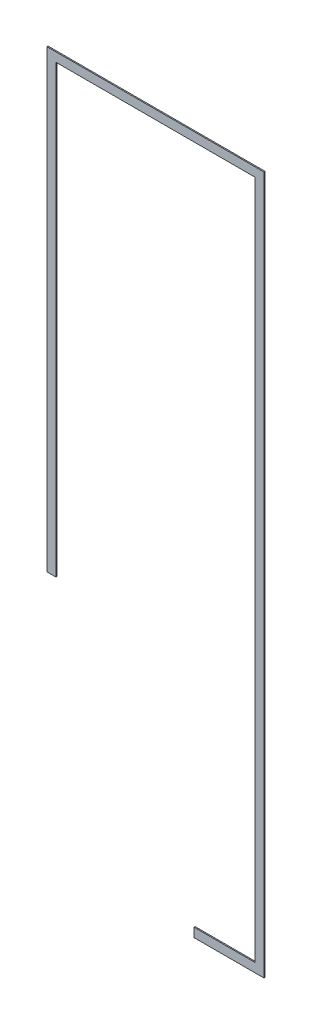
ISO-10303-21;
HEADER;
FILE_DESCRIPTION(('STEP AP214'),'2;1');
FILE_NAME('part.step','',(''),(''),'','','');
FILE_SCHEMA(('AUTOMOTIVE_DESIGN { 1 0 10303 214 1 1 1 1 }'));
ENDSEC;
DATA;
#1=APPLICATION_CONTEXT('core data for automotive mechanical design processes');
#2=APPLICATION_PROTOCOL_DEFINITION('international standard','automotive_design',2000,#1);
#3=PRODUCT_CONTEXT('',#1,'mechanical');
#4=PRODUCT('Part','Part','',(#3));
#5=PRODUCT_RELATED_PRODUCT_CATEGORY('part','',(#4));
#6=PRODUCT_DEFINITION_FORMATION('','',#4);
#7=PRODUCT_DEFINITION_CONTEXT('part definition',#1,'design');
#8=PRODUCT_DEFINITION('design','',#6,#7);
#9=PRODUCT_DEFINITION_SHAPE('','',#8);
#10=(LENGTH_UNIT() NAMED_UNIT(*) SI_UNIT(.MILLI.,.METRE.));
#11=(NAMED_UNIT(*) PLANE_ANGLE_UNIT() SI_UNIT($,.RADIAN.));
#12=(NAMED_UNIT(*) SI_UNIT($,.STERADIAN.) SOLID_ANGLE_UNIT());
#13=UNCERTAINTY_MEASURE_WITH_UNIT(LENGTH_MEASURE(1.E-05),#10,'distance_accuracy_value','');
#14=(GEOMETRIC_REPRESENTATION_CONTEXT(3) GLOBAL_UNCERTAINTY_ASSIGNED_CONTEXT((#13)) GLOBAL_UNIT_ASSIGNED_CONTEXT((#10,
#11,#12)) REPRESENTATION_CONTEXT('',''));
#15=CARTESIAN_POINT('',(0.,0.,0.));
#16=DIRECTION('',(0.,0.,1.));
#17=DIRECTION('',(1.,0.,0.));
#18=AXIS2_PLACEMENT_3D('',#15,#16,#17);
#19=CARTESIAN_POINT('',(5890.08691054199,-2228.56735908509,0.));
#20=DIRECTION('',(0.,0.,1.));
#21=DIRECTION('',(1.,0.,0.));
#22=AXIS2_PLACEMENT_3D('',#19,#20,#21);
#23=PLANE('',#22);
#24=DIRECTION('',(-1.,0.,0.));
#25=VECTOR('',#24,1.);
#26=CARTESIAN_POINT('',(5890.08691054199,-260.067359085082,0.));
#27=LINE('',#26,#25);
#28=CARTESIAN_POINT('',(6502.07451054199,-260.067359085083,0.));
#29=VERTEX_POINT('',#28);
#30=CARTESIAN_POINT('',(5278.09931054199,-260.067359085083,0.));
#31=VERTEX_POINT('',#30);
#32=EDGE_CURVE('E148',#29,#31,#27,.T.);
#33=ORIENTED_EDGE('',*,*,#32,.F.);
#34=DIRECTION('',(0.,1.,0.));
#35=VECTOR('',#34,1.);
#36=CARTESIAN_POINT('',(6502.07451054199,-2228.56735908509,0.));
#37=LINE('',#36,#35);
#38=CARTESIAN_POINT('',(6502.07451054199,-4197.06735908508,0.));
#39=VERTEX_POINT('',#38);
#40=EDGE_CURVE('E143',#39,#29,#37,.T.);
#41=ORIENTED_EDGE('',*,*,#40,.F.);
#42=DIRECTION('',(1.,0.,0.));
#43=VECTOR('',#42,1.);
#44=CARTESIAN_POINT('',(6305.22451054199,-4197.06735908508,0.));
#45=LINE('',#44,#43);
#46=CARTESIAN_POINT('',(6108.37451054199,-4197.06735908508,0.));
#47=VERTEX_POINT('',#46);
#48=EDGE_CURVE('E137',#47,#39,#45,.T.);
#49=ORIENTED_EDGE('',*,*,#48,.F.);
#50=DIRECTION('',(0.,1.,0.));
#51=VECTOR('',#50,1.);
#52=CARTESIAN_POINT('',(6108.37451054199,-4171.66735908508,0.));
#53=LINE('',#52,#51);
#54=CARTESIAN_POINT('',(6108.37451054199,-4146.26735908508,0.));
#55=VERTEX_POINT('',#54);
#56=EDGE_CURVE('E131',#55,#47,#53,.F.);
#57=ORIENTED_EDGE('',*,*,#56,.F.);
#58=DIRECTION('',(1.,0.,0.));
#59=VECTOR('',#58,1.);
#60=CARTESIAN_POINT('',(6279.82451054199,-4146.26735908508,0.));
#61=LINE('',#60,#59);
#62=CARTESIAN_POINT('',(6451.27451054199,-4146.26735908508,0.));
#63=VERTEX_POINT('',#62);
#64=EDGE_CURVE('E125',#63,#55,#61,.F.);
#65=ORIENTED_EDGE('',*,*,#64,.F.);
#66=DIRECTION('',(0.,-1.,0.));
#67=VECTOR('',#66,1.);
#68=CARTESIAN_POINT('',(6451.27451054199,-2228.56735908509,0.));
#69=LINE('',#68,#67);
#70=CARTESIAN_POINT('',(6451.27451054199,-310.867359085083,0.));
#71=VERTEX_POINT('',#70);
#72=EDGE_CURVE('E119',#71,#63,#69,.T.);
#73=ORIENTED_EDGE('',*,*,#72,.F.);
#74=DIRECTION('',(1.,0.,0.));
#75=VECTOR('',#74,1.);
#76=CARTESIAN_POINT('',(5890.08691054199,-310.867359085083,0.));
#77=LINE('',#76,#75);
#78=CARTESIAN_POINT('',(5328.89931054199,-310.867359085083,0.));
#79=VERTEX_POINT('',#78);
#80=EDGE_CURVE('E113',#79,#71,#77,.T.);
#81=ORIENTED_EDGE('',*,*,#80,.F.);
#82=DIRECTION('',(0.,1.,0.));
#83=VECTOR('',#82,1.);
#84=CARTESIAN_POINT('',(5328.89931054199,-1568.16735908509,0.));
#85=LINE('',#84,#83);
#86=CARTESIAN_POINT('',(5328.89931054199,-2825.46735908508,0.));
#87=VERTEX_POINT('',#86);
#88=EDGE_CURVE('E89',#87,#79,#85,.T.);
#89=ORIENTED_EDGE('',*,*,#88,.F.);
#90=DIRECTION('',(1.,0.,0.));
#91=VECTOR('',#90,1.);
#92=CARTESIAN_POINT('',(5303.49931054199,-2825.46735908508,0.));
#93=LINE('',#92,#91);
#94=CARTESIAN_POINT('',(5278.09931054199,-2825.46735908508,0.));
#95=VERTEX_POINT('',#94);
#96=EDGE_CURVE('E91',#95,#87,#93,.T.);
#97=ORIENTED_EDGE('',*,*,#96,.F.);
#98=DIRECTION('',(0.,1.,0.));
#99=VECTOR('',#98,1.);
#100=CARTESIAN_POINT('',(5278.09931054199,-1542.76735908508,0.));
#101=LINE('',#100,#99);
#102=EDGE_CURVE('E17',#31,#95,#101,.F.);
#103=ORIENTED_EDGE('',*,*,#102,.F.);
#104=EDGE_LOOP('',(#33,#41,#49,#57,#65,#73,#81,#89,#97,#103));
#105=FACE_BOUND('',#104,.T.);
#106=ADVANCED_FACE('F14',(#105),#23,.F.);
#107=CARTESIAN_POINT('',(5278.09931054199,-1542.76735908508,6.35));
#108=DIRECTION('',(-1.,0.,0.));
#109=DIRECTION('',(0.,0.,1.));
#110=AXIS2_PLACEMENT_3D('',#107,#108,#109);
#111=PLANE('',#110);
#112=DIRECTION('',(0.,1.,0.));
#113=VECTOR('',#112,1.);
#114=CARTESIAN_POINT('',(5278.09931054199,-2228.56735908509,6.35));
#115=LINE('',#114,#113);
#116=CARTESIAN_POINT('',(5278.09931054199,-260.067359085083,6.35));
#117=VERTEX_POINT('',#116);
#118=CARTESIAN_POINT('',(5278.09931054199,-2825.46735908508,6.35));
#119=VERTEX_POINT('',#118);
#120=EDGE_CURVE('E152',#117,#119,#115,.F.);
#121=ORIENTED_EDGE('',*,*,#120,.F.);
#122=DIRECTION('',(0.,0.,1.));
#123=VECTOR('',#122,1.);
#124=CARTESIAN_POINT('',(5278.09931054199,-260.067359085082,6.35));
#125=LINE('',#124,#123);
#126=EDGE_CURVE('E102',#31,#117,#125,.T.);
#127=ORIENTED_EDGE('',*,*,#126,.F.);
#128=ORIENTED_EDGE('',*,*,#102,.T.);
#129=DIRECTION('',(0.,0.,-1.));
#130=VECTOR('',#129,1.);
#131=CARTESIAN_POINT('',(5278.09931054199,-2825.46735908508,6.35));
#132=LINE('',#131,#130);
#133=EDGE_CURVE('E97',#119,#95,#132,.T.);
#134=ORIENTED_EDGE('',*,*,#133,.F.);
#135=EDGE_LOOP('',(#121,#127,#128,#134));
#136=FACE_BOUND('',#135,.T.);
#137=ADVANCED_FACE('F99',(#136),#111,.T.);
#138=CARTESIAN_POINT('',(5303.49931054199,-2825.46735908508,6.35));
#139=DIRECTION('',(0.,-1.,0.));
#140=DIRECTION('',(0.,0.,-1.));
#141=AXIS2_PLACEMENT_3D('',#138,#139,#140);
#142=PLANE('',#141);
#143=DIRECTION('',(1.,0.,0.));
#144=VECTOR('',#143,1.);
#145=CARTESIAN_POINT('',(5890.08691054199,-2825.46735908508,6.35));
#146=LINE('',#145,#144);
#147=CARTESIAN_POINT('',(5328.89931054199,-2825.46735908508,6.35));
#148=VERTEX_POINT('',#147);
#149=EDGE_CURVE('E106',#119,#148,#146,.T.);
#150=ORIENTED_EDGE('',*,*,#149,.F.);
#151=ORIENTED_EDGE('',*,*,#133,.T.);
#152=ORIENTED_EDGE('',*,*,#96,.T.);
#153=DIRECTION('',(0.,0.,-1.));
#154=VECTOR('',#153,1.);
#155=CARTESIAN_POINT('',(5328.89931054199,-2825.46735908508,6.35));
#156=LINE('',#155,#154);
#157=EDGE_CURVE('E109',#148,#87,#156,.T.);
#158=ORIENTED_EDGE('',*,*,#157,.F.);
#159=EDGE_LOOP('',(#150,#151,#152,#158));
#160=FACE_BOUND('',#159,.T.);
#161=ADVANCED_FACE('F104',(#160),#142,.T.);
#162=CARTESIAN_POINT('',(5328.89931054199,-1568.16735908509,6.35));
#163=DIRECTION('',(1.,0.,0.));
#164=DIRECTION('',(0.,0.,-1.));
#165=AXIS2_PLACEMENT_3D('',#162,#163,#164);
#166=PLANE('',#165);
#167=DIRECTION('',(0.,1.,0.));
#168=VECTOR('',#167,1.);
#169=CARTESIAN_POINT('',(5328.89931054199,-2228.56735908509,6.35));
#170=LINE('',#169,#168);
#171=CARTESIAN_POINT('',(5328.89931054199,-310.867359085083,6.35));
#172=VERTEX_POINT('',#171);
#173=EDGE_CURVE('E155',#148,#172,#170,.T.);
#174=ORIENTED_EDGE('',*,*,#173,.F.);
#175=ORIENTED_EDGE('',*,*,#157,.T.);
#176=ORIENTED_EDGE('',*,*,#88,.T.);
#177=DIRECTION('',(0.,0.,1.));
#178=VECTOR('',#177,1.);
#179=CARTESIAN_POINT('',(5328.89931054199,-310.867359085083,6.35));
#180=LINE('',#179,#178);
#181=EDGE_CURVE('E116',#172,#79,#180,.F.);
#182=ORIENTED_EDGE('',*,*,#181,.F.);
#183=EDGE_LOOP('',(#174,#175,#176,#182));
#184=FACE_BOUND('',#183,.T.);
#185=ADVANCED_FACE('F194',(#184),#166,.T.);
#186=CARTESIAN_POINT('',(5890.08691054199,-310.867359085083,6.35));
#187=DIRECTION('',(0.,-1.,0.));
#188=DIRECTION('',(1.,0.,0.));
#189=AXIS2_PLACEMENT_3D('',#186,#187,#188);
#190=PLANE('',#189);
#191=DIRECTION('',(1.,0.,0.));
#192=VECTOR('',#191,1.);
#193=CARTESIAN_POINT('',(5890.08691054199,-310.867359085083,6.35));
#194=LINE('',#193,#192);
#195=CARTESIAN_POINT('',(6451.27451054199,-310.867359085083,6.35));
#196=VERTEX_POINT('',#195);
#197=EDGE_CURVE('E158',#172,#196,#194,.T.);
#198=ORIENTED_EDGE('',*,*,#197,.F.);
#199=ORIENTED_EDGE('',*,*,#181,.T.);
#200=ORIENTED_EDGE('',*,*,#80,.T.);
#201=DIRECTION('',(0.,0.,1.));
#202=VECTOR('',#201,1.);
#203=CARTESIAN_POINT('',(6451.27451054199,-310.867359085083,6.35));
#204=LINE('',#203,#202);
#205=EDGE_CURVE('E122',#196,#71,#204,.F.);
#206=ORIENTED_EDGE('',*,*,#205,.F.);
#207=EDGE_LOOP('',(#198,#199,#200,#206));
#208=FACE_BOUND('',#207,.T.);
#209=ADVANCED_FACE('F191',(#208),#190,.T.);
#210=CARTESIAN_POINT('',(6451.27451054199,-2228.56735908509,6.35));
#211=DIRECTION('',(-1.,0.,0.));
#212=DIRECTION('',(0.,-1.,0.));
#213=AXIS2_PLACEMENT_3D('',#210,#211,#212);
#214=PLANE('',#213);
#215=DIRECTION('',(0.,1.,0.));
#216=VECTOR('',#215,1.);
#217=CARTESIAN_POINT('',(6451.27451054199,-2228.56735908509,6.35));
#218=LINE('',#217,#216);
#219=CARTESIAN_POINT('',(6451.27451054199,-4146.26735908508,6.35));
#220=VERTEX_POINT('',#219);
#221=EDGE_CURVE('E161',#196,#220,#218,.F.);
#222=ORIENTED_EDGE('',*,*,#221,.F.);
#223=ORIENTED_EDGE('',*,*,#205,.T.);
#224=ORIENTED_EDGE('',*,*,#72,.T.);
#225=DIRECTION('',(0.,0.,1.));
#226=VECTOR('',#225,1.);
#227=CARTESIAN_POINT('',(6451.27451054199,-4146.26735908508,6.35));
#228=LINE('',#227,#226);
#229=EDGE_CURVE('E128',#220,#63,#228,.F.);
#230=ORIENTED_EDGE('',*,*,#229,.F.);
#231=EDGE_LOOP('',(#222,#223,#224,#230));
#232=FACE_BOUND('',#231,.T.);
#233=ADVANCED_FACE('F188',(#232),#214,.T.);
#234=CARTESIAN_POINT('',(6279.82451054199,-4146.26735908508,6.35));
#235=DIRECTION('',(0.,1.,0.));
#236=DIRECTION('',(0.,0.,1.));
#237=AXIS2_PLACEMENT_3D('',#234,#235,#236);
#238=PLANE('',#237);
#239=DIRECTION('',(1.,0.,0.));
#240=VECTOR('',#239,1.);
#241=CARTESIAN_POINT('',(5890.08691054199,-4146.26735908508,6.35));
#242=LINE('',#241,#240);
#243=CARTESIAN_POINT('',(6108.37451054199,-4146.26735908508,6.35));
#244=VERTEX_POINT('',#243);
#245=EDGE_CURVE('E164',#220,#244,#242,.F.);
#246=ORIENTED_EDGE('',*,*,#245,.F.);
#247=ORIENTED_EDGE('',*,*,#229,.T.);
#248=ORIENTED_EDGE('',*,*,#64,.T.);
#249=DIRECTION('',(0.,0.,1.));
#250=VECTOR('',#249,1.);
#251=CARTESIAN_POINT('',(6108.37451054199,-4146.26735908508,6.35));
#252=LINE('',#251,#250);
#253=EDGE_CURVE('E134',#244,#55,#252,.F.);
#254=ORIENTED_EDGE('',*,*,#253,.F.);
#255=EDGE_LOOP('',(#246,#247,#248,#254));
#256=FACE_BOUND('',#255,.T.);
#257=ADVANCED_FACE('F185',(#256),#238,.T.);
#258=CARTESIAN_POINT('',(6108.37451054199,-4171.66735908508,6.35));
#259=DIRECTION('',(-1.,0.,0.));
#260=DIRECTION('',(0.,0.,1.));
#261=AXIS2_PLACEMENT_3D('',#258,#259,#260);
#262=PLANE('',#261);
#263=DIRECTION('',(0.,1.,0.));
#264=VECTOR('',#263,1.);
#265=CARTESIAN_POINT('',(6108.37451054199,-2228.56735908509,6.35));
#266=LINE('',#265,#264);
#267=CARTESIAN_POINT('',(6108.37451054199,-4197.06735908508,6.35));
#268=VERTEX_POINT('',#267);
#269=EDGE_CURVE('E167',#244,#268,#266,.F.);
#270=ORIENTED_EDGE('',*,*,#269,.F.);
#271=ORIENTED_EDGE('',*,*,#253,.T.);
#272=ORIENTED_EDGE('',*,*,#56,.T.);
#273=DIRECTION('',(0.,0.,-1.));
#274=VECTOR('',#273,1.);
#275=CARTESIAN_POINT('',(6108.37451054199,-4197.06735908508,6.35));
#276=LINE('',#275,#274);
#277=EDGE_CURVE('E140',#268,#47,#276,.T.);
#278=ORIENTED_EDGE('',*,*,#277,.F.);
#279=EDGE_LOOP('',(#270,#271,#272,#278));
#280=FACE_BOUND('',#279,.T.);
#281=ADVANCED_FACE('F182',(#280),#262,.T.);
#282=CARTESIAN_POINT('',(6305.22451054199,-4197.06735908508,6.35));
#283=DIRECTION('',(0.,-1.,0.));
#284=DIRECTION('',(0.,0.,-1.));
#285=AXIS2_PLACEMENT_3D('',#282,#283,#284);
#286=PLANE('',#285);
#287=DIRECTION('',(1.,0.,0.));
#288=VECTOR('',#287,1.);
#289=CARTESIAN_POINT('',(5890.08691054199,-4197.06735908508,6.35));
#290=LINE('',#289,#288);
#291=CARTESIAN_POINT('',(6502.07451054199,-4197.06735908508,6.35));
#292=VERTEX_POINT('',#291);
#293=EDGE_CURVE('E170',#268,#292,#290,.T.);
#294=ORIENTED_EDGE('',*,*,#293,.F.);
#295=ORIENTED_EDGE('',*,*,#277,.T.);
#296=ORIENTED_EDGE('',*,*,#48,.T.);
#297=DIRECTION('',(0.,0.,-1.));
#298=VECTOR('',#297,1.);
#299=CARTESIAN_POINT('',(6502.07451054199,-4197.06735908508,6.35));
#300=LINE('',#299,#298);
#301=EDGE_CURVE('E145',#292,#39,#300,.T.);
#302=ORIENTED_EDGE('',*,*,#301,.F.);
#303=EDGE_LOOP('',(#294,#295,#296,#302));
#304=FACE_BOUND('',#303,.T.);
#305=ADVANCED_FACE('F179',(#304),#286,.T.);
#306=CARTESIAN_POINT('',(6502.07451054199,-2228.56735908509,6.35));
#307=DIRECTION('',(1.,0.,0.));
#308=DIRECTION('',(0.,0.,-1.));
#309=AXIS2_PLACEMENT_3D('',#306,#307,#308);
#310=PLANE('',#309);
#311=DIRECTION('',(0.,1.,0.));
#312=VECTOR('',#311,1.);
#313=CARTESIAN_POINT('',(6502.07451054199,-2228.56735908509,6.35));
#314=LINE('',#313,#312);
#315=CARTESIAN_POINT('',(6502.07451054199,-260.067359085083,6.35));
#316=VERTEX_POINT('',#315);
#317=EDGE_CURVE('E23',#292,#316,#314,.T.);
#318=ORIENTED_EDGE('',*,*,#317,.F.);
#319=ORIENTED_EDGE('',*,*,#301,.T.);
#320=ORIENTED_EDGE('',*,*,#40,.T.);
#321=DIRECTION('',(0.,0.,1.));
#322=VECTOR('',#321,1.);
#323=CARTESIAN_POINT('',(6502.07451054199,-260.067359085082,6.35));
#324=LINE('',#323,#322);
#325=EDGE_CURVE('E32',#316,#29,#324,.F.);
#326=ORIENTED_EDGE('',*,*,#325,.F.);
#327=EDGE_LOOP('',(#318,#319,#320,#326));
#328=FACE_BOUND('',#327,.T.);
#329=ADVANCED_FACE('F177',(#328),#310,.T.);
#330=CARTESIAN_POINT('',(5890.08691054199,-260.067359085082,6.35));
#331=DIRECTION('',(0.,1.,0.));
#332=DIRECTION('',(-1.,0.,0.));
#333=AXIS2_PLACEMENT_3D('',#330,#331,#332);
#334=PLANE('',#333);
#335=DIRECTION('',(1.,0.,0.));
#336=VECTOR('',#335,1.);
#337=CARTESIAN_POINT('',(5890.08691054199,-260.067359085083,6.35));
#338=LINE('',#337,#336);
#339=EDGE_CURVE('E9',#316,#117,#338,.F.);
#340=ORIENTED_EDGE('',*,*,#339,.F.);
#341=ORIENTED_EDGE('',*,*,#325,.T.);
#342=ORIENTED_EDGE('',*,*,#32,.T.);
#343=ORIENTED_EDGE('',*,*,#126,.T.);
#344=EDGE_LOOP('',(#340,#341,#342,#343));
#345=FACE_BOUND('',#344,.T.);
#346=ADVANCED_FACE('F196',(#345),#334,.T.);
#347=CARTESIAN_POINT('',(5890.08691054199,-2228.56735908509,6.35));
#348=DIRECTION('',(0.,0.,1.));
#349=DIRECTION('',(1.,0.,0.));
#350=AXIS2_PLACEMENT_3D('',#347,#348,#349);
#351=PLANE('',#350);
#352=ORIENTED_EDGE('',*,*,#317,.T.);
#353=ORIENTED_EDGE('',*,*,#339,.T.);
#354=ORIENTED_EDGE('',*,*,#120,.T.);
#355=ORIENTED_EDGE('',*,*,#149,.T.);
#356=ORIENTED_EDGE('',*,*,#173,.T.);
#357=ORIENTED_EDGE('',*,*,#197,.T.);
#358=ORIENTED_EDGE('',*,*,#221,.T.);
#359=ORIENTED_EDGE('',*,*,#245,.T.);
#360=ORIENTED_EDGE('',*,*,#269,.T.);
#361=ORIENTED_EDGE('',*,*,#293,.T.);
#362=EDGE_LOOP('',(#352,#353,#354,#355,#356,#357,#358,#359,#360,#361));
#363=FACE_BOUND('',#362,.T.);
#364=ADVANCED_FACE('F175',(#363),#351,.T.);
#365=CLOSED_SHELL('',(#106,#137,#161,#185,#209,#233,#257,#281,#305,#329,#346,#364));
#366=MANIFOLD_SOLID_BREP('B1',#365);
#367=ADVANCED_BREP_SHAPE_REPRESENTATION('',(#18,#366),#14);
#368=SHAPE_DEFINITION_REPRESENTATION(#9,#367);
ENDSEC;
END-ISO-10303-21;
